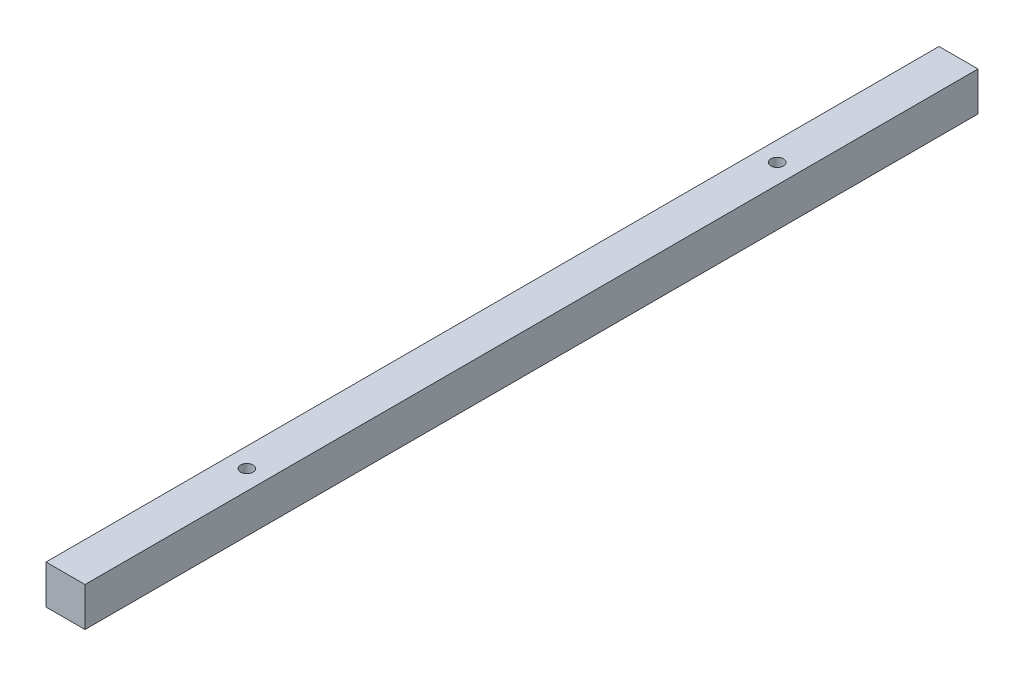
ISO-10303-21;
HEADER;
FILE_DESCRIPTION(('STEP AP214'),'2;1');
FILE_NAME('part.step','',(''),(''),'','','');
FILE_SCHEMA(('AUTOMOTIVE_DESIGN { 1 0 10303 214 1 1 1 1 }'));
ENDSEC;
DATA;
#1=APPLICATION_CONTEXT('core data for automotive mechanical design processes');
#2=APPLICATION_PROTOCOL_DEFINITION('international standard','automotive_design',2000,#1);
#3=PRODUCT_CONTEXT('',#1,'mechanical');
#4=PRODUCT('Part','Part','',(#3));
#5=PRODUCT_RELATED_PRODUCT_CATEGORY('part','',(#4));
#6=PRODUCT_DEFINITION_FORMATION('','',#4);
#7=PRODUCT_DEFINITION_CONTEXT('part definition',#1,'design');
#8=PRODUCT_DEFINITION('design','',#6,#7);
#9=PRODUCT_DEFINITION_SHAPE('','',#8);
#10=(LENGTH_UNIT() NAMED_UNIT(*) SI_UNIT(.MILLI.,.METRE.));
#11=(NAMED_UNIT(*) PLANE_ANGLE_UNIT() SI_UNIT($,.RADIAN.));
#12=(NAMED_UNIT(*) SI_UNIT($,.STERADIAN.) SOLID_ANGLE_UNIT());
#13=UNCERTAINTY_MEASURE_WITH_UNIT(LENGTH_MEASURE(1.E-05),#10,'distance_accuracy_value','');
#14=(GEOMETRIC_REPRESENTATION_CONTEXT(3) GLOBAL_UNCERTAINTY_ASSIGNED_CONTEXT((#13)) GLOBAL_UNIT_ASSIGNED_CONTEXT((#10,
#11,#12)) REPRESENTATION_CONTEXT('',''));
#15=CARTESIAN_POINT('',(0.,0.,0.));
#16=DIRECTION('',(0.,0.,1.));
#17=DIRECTION('',(1.,0.,0.));
#18=AXIS2_PLACEMENT_3D('',#15,#16,#17);
#19=CARTESIAN_POINT('',(-5.,5.,128.642135623731));
#20=DIRECTION('',(1.,0.,0.));
#21=DIRECTION('',(0.,1.,0.));
#22=AXIS2_PLACEMENT_3D('',#19,#20,#21);
#23=PLANE('',#22);
#24=DIRECTION('',(0.,-1.,0.));
#25=VECTOR('',#24,1.);
#26=CARTESIAN_POINT('',(-5.,5.,114.5));
#27=LINE('',#26,#25);
#28=CARTESIAN_POINT('',(-4.99999999999999,5.,114.5));
#29=VERTEX_POINT('',#28);
#30=CARTESIAN_POINT('',(-4.99999999999999,-5.,114.5));
#31=VERTEX_POINT('',#30);
#32=EDGE_CURVE('E36',#29,#31,#27,.T.);
#33=ORIENTED_EDGE('',*,*,#32,.F.);
#34=DIRECTION('',(0.,0.,-1.));
#35=VECTOR('',#34,1.);
#36=CARTESIAN_POINT('',(-5.,5.,128.642135623731));
#37=LINE('',#36,#35);
#38=CARTESIAN_POINT('',(-5.,5.,-114.5));
#39=VERTEX_POINT('',#38);
#40=EDGE_CURVE('E103',#29,#39,#37,.T.);
#41=ORIENTED_EDGE('',*,*,#40,.T.);
#42=DIRECTION('',(0.,-1.,0.));
#43=VECTOR('',#42,1.);
#44=CARTESIAN_POINT('',(-5.,5.,-114.5));
#45=LINE('',#44,#43);
#46=CARTESIAN_POINT('',(-5.00000000000001,-5.,-114.5));
#47=VERTEX_POINT('',#46);
#48=EDGE_CURVE('E101',#39,#47,#45,.T.);
#49=ORIENTED_EDGE('',*,*,#48,.T.);
#50=DIRECTION('',(0.,0.,-1.));
#51=VECTOR('',#50,1.);
#52=CARTESIAN_POINT('',(-5.,-5.,128.642135623731));
#53=LINE('',#52,#51);
#54=EDGE_CURVE('E78',#31,#47,#53,.T.);
#55=ORIENTED_EDGE('',*,*,#54,.F.);
#56=EDGE_LOOP('',(#33,#41,#49,#55));
#57=FACE_BOUND('',#56,.T.);
#58=ADVANCED_FACE('F33',(#57),#23,.F.);
#59=CARTESIAN_POINT('',(-5.,-5.,128.642135623731));
#60=DIRECTION('',(0.,1.,0.));
#61=DIRECTION('',(0.,0.,1.));
#62=AXIS2_PLACEMENT_3D('',#59,#60,#61);
#63=PLANE('',#62);
#64=CARTESIAN_POINT('',(0.,-5.,68.));
#65=DIRECTION('',(0.,1.,0.));
#66=DIRECTION('',(0.,0.,1.));
#67=AXIS2_PLACEMENT_3D('',#64,#65,#66);
#68=CIRCLE('',#67,1.6);
#69=CARTESIAN_POINT('',(0.,-5.,69.6));
#70=VERTEX_POINT('',#69);
#71=EDGE_CURVE('E144',#70,#70,#68,.T.);
#72=ORIENTED_EDGE('',*,*,#71,.T.);
#73=EDGE_LOOP('',(#72));
#74=FACE_BOUND('',#73,.T.);
#75=CARTESIAN_POINT('',(0.,-5.,-68.));
#76=DIRECTION('',(0.,1.,0.));
#77=DIRECTION('',(0.,0.,1.));
#78=AXIS2_PLACEMENT_3D('',#75,#76,#77);
#79=CIRCLE('',#78,1.6);
#80=CARTESIAN_POINT('',(0.,-5.,-66.4));
#81=VERTEX_POINT('',#80);
#82=EDGE_CURVE('E93',#81,#81,#79,.T.);
#83=ORIENTED_EDGE('',*,*,#82,.T.);
#84=EDGE_LOOP('',(#83));
#85=FACE_BOUND('',#84,.T.);
#86=DIRECTION('',(1.,0.,0.));
#87=VECTOR('',#86,1.);
#88=CARTESIAN_POINT('',(-5.,-5.,114.5));
#89=LINE('',#88,#87);
#90=CARTESIAN_POINT('',(5.00000000000001,-5.,114.5));
#91=VERTEX_POINT('',#90);
#92=EDGE_CURVE('E48',#31,#91,#89,.T.);
#93=ORIENTED_EDGE('',*,*,#92,.F.);
#94=ORIENTED_EDGE('',*,*,#54,.T.);
#95=DIRECTION('',(1.,0.,0.));
#96=VECTOR('',#95,1.);
#97=CARTESIAN_POINT('',(-5.,-5.,-114.5));
#98=LINE('',#97,#96);
#99=CARTESIAN_POINT('',(5.,-5.,-114.5));
#100=VERTEX_POINT('',#99);
#101=EDGE_CURVE('E86',#47,#100,#98,.T.);
#102=ORIENTED_EDGE('',*,*,#101,.T.);
#103=DIRECTION('',(0.,0.,-1.));
#104=VECTOR('',#103,1.);
#105=CARTESIAN_POINT('',(5.,-5.,128.642135623731));
#106=LINE('',#105,#104);
#107=EDGE_CURVE('E70',#91,#100,#106,.T.);
#108=ORIENTED_EDGE('',*,*,#107,.F.);
#109=EDGE_LOOP('',(#93,#94,#102,#108));
#110=FACE_BOUND('',#109,.T.);
#111=ADVANCED_FACE('F91',(#74,#85,#110),#63,.F.);
#112=CARTESIAN_POINT('',(5.,5.,128.642135623731));
#113=DIRECTION('',(-1.,0.,0.));
#114=DIRECTION('',(0.,-1.,0.));
#115=AXIS2_PLACEMENT_3D('',#112,#113,#114);
#116=PLANE('',#115);
#117=DIRECTION('',(0.,1.,0.));
#118=VECTOR('',#117,1.);
#119=CARTESIAN_POINT('',(5.,5.,114.5));
#120=LINE('',#119,#118);
#121=CARTESIAN_POINT('',(5.,5.,114.5));
#122=VERTEX_POINT('',#121);
#123=EDGE_CURVE('E75',#91,#122,#120,.T.);
#124=ORIENTED_EDGE('',*,*,#123,.F.);
#125=ORIENTED_EDGE('',*,*,#107,.T.);
#126=DIRECTION('',(0.,1.,0.));
#127=VECTOR('',#126,1.);
#128=CARTESIAN_POINT('',(5.,5.,-114.5));
#129=LINE('',#128,#127);
#130=CARTESIAN_POINT('',(4.99999999999999,5.,-114.5));
#131=VERTEX_POINT('',#130);
#132=EDGE_CURVE('E74',#100,#131,#129,.T.);
#133=ORIENTED_EDGE('',*,*,#132,.T.);
#134=DIRECTION('',(0.,0.,-1.));
#135=VECTOR('',#134,1.);
#136=CARTESIAN_POINT('',(5.,5.,128.642135623731));
#137=LINE('',#136,#135);
#138=EDGE_CURVE('E79',#122,#131,#137,.T.);
#139=ORIENTED_EDGE('',*,*,#138,.F.);
#140=EDGE_LOOP('',(#124,#125,#133,#139));
#141=FACE_BOUND('',#140,.T.);
#142=ADVANCED_FACE('F72',(#141),#116,.F.);
#143=CARTESIAN_POINT('',(-5.,5.,128.642135623731));
#144=DIRECTION('',(0.,-1.,0.));
#145=DIRECTION('',(0.,0.,-1.));
#146=AXIS2_PLACEMENT_3D('',#143,#144,#145);
#147=PLANE('',#146);
#148=CARTESIAN_POINT('',(0.,5.,68.));
#149=DIRECTION('',(0.,1.,0.));
#150=DIRECTION('',(0.,0.,1.));
#151=AXIS2_PLACEMENT_3D('',#148,#149,#150);
#152=CIRCLE('',#151,1.6);
#153=CARTESIAN_POINT('',(0.,5.,69.6));
#154=VERTEX_POINT('',#153);
#155=EDGE_CURVE('E147',#154,#154,#152,.T.);
#156=ORIENTED_EDGE('',*,*,#155,.F.);
#157=EDGE_LOOP('',(#156));
#158=FACE_BOUND('',#157,.T.);
#159=CARTESIAN_POINT('',(0.,5.,-68.));
#160=DIRECTION('',(0.,1.,0.));
#161=DIRECTION('',(0.,0.,1.));
#162=AXIS2_PLACEMENT_3D('',#159,#160,#161);
#163=CIRCLE('',#162,1.6);
#164=CARTESIAN_POINT('',(0.,5.,-66.4));
#165=VERTEX_POINT('',#164);
#166=EDGE_CURVE('E96',#165,#165,#163,.T.);
#167=ORIENTED_EDGE('',*,*,#166,.F.);
#168=EDGE_LOOP('',(#167));
#169=FACE_BOUND('',#168,.T.);
#170=DIRECTION('',(-1.,0.,0.));
#171=VECTOR('',#170,1.);
#172=CARTESIAN_POINT('',(-5.,5.,114.5));
#173=LINE('',#172,#171);
#174=EDGE_CURVE('E11',#122,#29,#173,.T.);
#175=ORIENTED_EDGE('',*,*,#174,.F.);
#176=ORIENTED_EDGE('',*,*,#138,.T.);
#177=DIRECTION('',(-1.,0.,0.));
#178=VECTOR('',#177,1.);
#179=CARTESIAN_POINT('',(-5.,5.,-114.5));
#180=LINE('',#179,#178);
#181=EDGE_CURVE('E89',#131,#39,#180,.T.);
#182=ORIENTED_EDGE('',*,*,#181,.T.);
#183=ORIENTED_EDGE('',*,*,#40,.F.);
#184=EDGE_LOOP('',(#175,#176,#182,#183));
#185=FACE_BOUND('',#184,.T.);
#186=ADVANCED_FACE('F111',(#158,#169,#185),#147,.F.);
#187=CARTESIAN_POINT('',(0.,-12.,114.5));
#188=DIRECTION('',(0.,0.,1.));
#189=DIRECTION('',(0.,-1.,0.));
#190=AXIS2_PLACEMENT_3D('',#187,#188,#189);
#191=PLANE('',#190);
#192=ORIENTED_EDGE('',*,*,#92,.T.);
#193=ORIENTED_EDGE('',*,*,#123,.T.);
#194=ORIENTED_EDGE('',*,*,#174,.T.);
#195=ORIENTED_EDGE('',*,*,#32,.T.);
#196=EDGE_LOOP('',(#192,#193,#194,#195));
#197=FACE_BOUND('',#196,.T.);
#198=ADVANCED_FACE('F107',(#197),#191,.T.);
#199=CARTESIAN_POINT('',(0.,-12.,-114.5));
#200=DIRECTION('',(0.,0.,-1.));
#201=DIRECTION('',(0.,-1.,0.));
#202=AXIS2_PLACEMENT_3D('',#199,#200,#201);
#203=PLANE('',#202);
#204=ORIENTED_EDGE('',*,*,#101,.F.);
#205=ORIENTED_EDGE('',*,*,#48,.F.);
#206=ORIENTED_EDGE('',*,*,#181,.F.);
#207=ORIENTED_EDGE('',*,*,#132,.F.);
#208=EDGE_LOOP('',(#204,#205,#206,#207));
#209=FACE_BOUND('',#208,.T.);
#210=ADVANCED_FACE('F84',(#209),#203,.T.);
#211=CARTESIAN_POINT('',(0.,-5.,-68.));
#212=DIRECTION('',(0.,1.,0.));
#213=DIRECTION('',(0.,0.,1.));
#214=AXIS2_PLACEMENT_3D('',#211,#212,#213);
#215=CYLINDRICAL_SURFACE('',#214,1.6);
#216=ORIENTED_EDGE('',*,*,#82,.F.);
#217=EDGE_LOOP('',(#216));
#218=FACE_BOUND('',#217,.T.);
#219=ORIENTED_EDGE('',*,*,#166,.T.);
#220=EDGE_LOOP('',(#219));
#221=FACE_BOUND('',#220,.T.);
#222=ADVANCED_FACE('F133',(#218,#221),#215,.F.);
#223=CARTESIAN_POINT('',(0.,-5.,68.));
#224=DIRECTION('',(0.,1.,0.));
#225=DIRECTION('',(0.,0.,1.));
#226=AXIS2_PLACEMENT_3D('',#223,#224,#225);
#227=CYLINDRICAL_SURFACE('',#226,1.6);
#228=ORIENTED_EDGE('',*,*,#71,.F.);
#229=EDGE_LOOP('',(#228));
#230=FACE_BOUND('',#229,.T.);
#231=ORIENTED_EDGE('',*,*,#155,.T.);
#232=EDGE_LOOP('',(#231));
#233=FACE_BOUND('',#232,.T.);
#234=ADVANCED_FACE('F136',(#230,#233),#227,.F.);
#235=CLOSED_SHELL('',(#58,#111,#142,#186,#198,#210,#222,#234));
#236=MANIFOLD_SOLID_BREP('B2',#235);
#237=ADVANCED_BREP_SHAPE_REPRESENTATION('',(#18,#236),#14);
#238=SHAPE_DEFINITION_REPRESENTATION(#9,#237);
ENDSEC;
END-ISO-10303-21;
